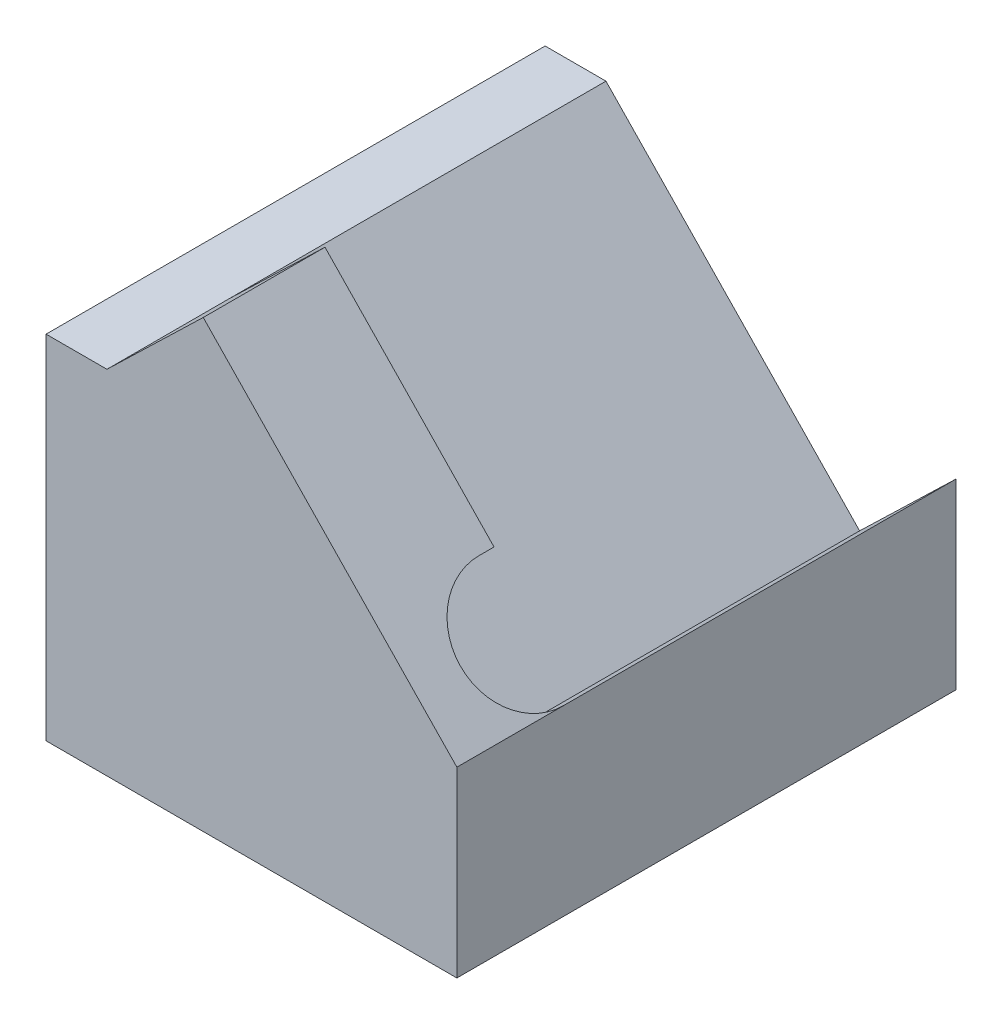
ISO-10303-21;
HEADER;
FILE_DESCRIPTION(('STEP AP214'),'2;1');
FILE_NAME('part.step','',(''),(''),'','','');
FILE_SCHEMA(('AUTOMOTIVE_DESIGN { 1 0 10303 214 1 1 1 1 }'));
ENDSEC;
DATA;
#1=APPLICATION_CONTEXT('core data for automotive mechanical design processes');
#2=APPLICATION_PROTOCOL_DEFINITION('international standard','automotive_design',2000,#1);
#3=PRODUCT_CONTEXT('',#1,'mechanical');
#4=PRODUCT('Part','Part','',(#3));
#5=PRODUCT_RELATED_PRODUCT_CATEGORY('part','',(#4));
#6=PRODUCT_DEFINITION_FORMATION('','',#4);
#7=PRODUCT_DEFINITION_CONTEXT('part definition',#1,'design');
#8=PRODUCT_DEFINITION('design','',#6,#7);
#9=PRODUCT_DEFINITION_SHAPE('','',#8);
#10=(LENGTH_UNIT() NAMED_UNIT(*) SI_UNIT(.MILLI.,.METRE.));
#11=(NAMED_UNIT(*) PLANE_ANGLE_UNIT() SI_UNIT($,.RADIAN.));
#12=(NAMED_UNIT(*) SI_UNIT($,.STERADIAN.) SOLID_ANGLE_UNIT());
#13=UNCERTAINTY_MEASURE_WITH_UNIT(LENGTH_MEASURE(1.E-05),#10,'distance_accuracy_value','');
#14=(GEOMETRIC_REPRESENTATION_CONTEXT(3) GLOBAL_UNCERTAINTY_ASSIGNED_CONTEXT((#13)) GLOBAL_UNIT_ASSIGNED_CONTEXT((#10,
#11,#12)) REPRESENTATION_CONTEXT('',''));
#15=CARTESIAN_POINT('',(0.,0.,0.));
#16=DIRECTION('',(0.,0.,1.));
#17=DIRECTION('',(1.,0.,0.));
#18=AXIS2_PLACEMENT_3D('',#15,#16,#17);
#19=CARTESIAN_POINT('',(6.75,2.,8.2));
#20=DIRECTION('',(-1.,0.,0.));
#21=DIRECTION('',(0.,0.,1.));
#22=AXIS2_PLACEMENT_3D('',#19,#20,#21);
#23=PLANE('',#22);
#24=DIRECTION('',(0.,1.,0.));
#25=VECTOR('',#24,1.);
#26=CARTESIAN_POINT('',(6.75,2.,0.));
#27=LINE('',#26,#25);
#28=CARTESIAN_POINT('',(6.75,-1.,0.));
#29=VERTEX_POINT('',#28);
#30=CARTESIAN_POINT('',(6.75,2.,0.));
#31=VERTEX_POINT('',#30);
#32=EDGE_CURVE('E115',#29,#31,#27,.T.);
#33=ORIENTED_EDGE('',*,*,#32,.T.);
#34=DIRECTION('',(0.,0.,-1.));
#35=VECTOR('',#34,1.);
#36=CARTESIAN_POINT('',(6.75,2.,0.));
#37=LINE('',#36,#35);
#38=CARTESIAN_POINT('',(6.75,2.,6.45));
#39=VERTEX_POINT('',#38);
#40=EDGE_CURVE('E155',#39,#31,#37,.T.);
#41=ORIENTED_EDGE('',*,*,#40,.F.);
#42=DIRECTION('',(0.,0.,-1.));
#43=VECTOR('',#42,1.);
#44=CARTESIAN_POINT('',(6.75,2.,8.2));
#45=LINE('',#44,#43);
#46=CARTESIAN_POINT('',(6.75,2.,8.2));
#47=VERTEX_POINT('',#46);
#48=EDGE_CURVE('E11',#47,#39,#45,.T.);
#49=ORIENTED_EDGE('',*,*,#48,.F.);
#50=DIRECTION('',(0.,1.,0.));
#51=VECTOR('',#50,1.);
#52=CARTESIAN_POINT('',(6.75,2.,8.2));
#53=LINE('',#52,#51);
#54=CARTESIAN_POINT('',(6.75,-1.,8.2));
#55=VERTEX_POINT('',#54);
#56=EDGE_CURVE('E93',#55,#47,#53,.T.);
#57=ORIENTED_EDGE('',*,*,#56,.F.);
#58=DIRECTION('',(0.,0.,1.));
#59=VECTOR('',#58,1.);
#60=CARTESIAN_POINT('',(6.75,-1.,8.2));
#61=LINE('',#60,#59);
#62=EDGE_CURVE('E144',#29,#55,#61,.T.);
#63=ORIENTED_EDGE('',*,*,#62,.F.);
#64=EDGE_LOOP('',(#33,#41,#49,#57,#63));
#65=FACE_BOUND('',#64,.T.);
#66=ADVANCED_FACE('F35',(#65),#23,.F.);
#67=CARTESIAN_POINT('',(2.58254756074503,6.31552333212895,8.2));
#68=DIRECTION('',(-0.71933980033865,-0.694658370458999,0.));
#69=DIRECTION('',(0.694658370458999,-0.71933980033865,0.));
#70=AXIS2_PLACEMENT_3D('',#67,#68,#69);
#71=PLANE('',#70);
#72=ORIENTED_EDGE('',*,*,#48,.T.);
#73=CARTESIAN_POINT('',(6.055341629541,2.71933980033865,6.45));
#74=DIRECTION('',(0.719339800338649,0.694658370458999,0.));
#75=DIRECTION('',(0.694658370458999,-0.719339800338649,0.));
#76=AXIS2_PLACEMENT_3D('',#73,#74,#75);
#77=CIRCLE('',#76,1.);
#78=CARTESIAN_POINT('',(5.360683259082,3.4386796006773,6.45));
#79=VERTEX_POINT('',#78);
#80=EDGE_CURVE('E166',#79,#39,#77,.T.);
#81=ORIENTED_EDGE('',*,*,#80,.F.);
#82=DIRECTION('',(0.,0.,1.));
#83=VECTOR('',#82,1.);
#84=CARTESIAN_POINT('',(5.360683259082,3.4386796006773,6.45));
#85=LINE('',#84,#83);
#86=CARTESIAN_POINT('',(5.360683259082,3.4386796006773,6.2));
#87=VERTEX_POINT('',#86);
#88=EDGE_CURVE('E146',#87,#79,#85,.T.);
#89=ORIENTED_EDGE('',*,*,#88,.F.);
#90=DIRECTION('',(0.694658370458999,-0.719339800338649,0.));
#91=VECTOR('',#90,1.);
#92=CARTESIAN_POINT('',(5.360683259082,3.4386796006773,6.2));
#93=LINE('',#92,#91);
#94=CARTESIAN_POINT('',(2.58254756074503,6.31552333212896,6.2));
#95=VERTEX_POINT('',#94);
#96=EDGE_CURVE('E102',#95,#87,#93,.T.);
#97=ORIENTED_EDGE('',*,*,#96,.F.);
#98=DIRECTION('',(0.,0.,-1.));
#99=VECTOR('',#98,1.);
#100=CARTESIAN_POINT('',(2.58254756074503,6.31552333212895,8.2));
#101=LINE('',#100,#99);
#102=CARTESIAN_POINT('',(2.58254756074503,6.31552333212895,8.2));
#103=VERTEX_POINT('',#102);
#104=EDGE_CURVE('E42',#103,#95,#101,.T.);
#105=ORIENTED_EDGE('',*,*,#104,.F.);
#106=DIRECTION('',(-0.694658370458999,0.719339800338649,0.));
#107=VECTOR('',#106,1.);
#108=CARTESIAN_POINT('',(2.58254756074503,6.31552333212895,8.2));
#109=LINE('',#108,#107);
#110=EDGE_CURVE('E85',#47,#103,#109,.T.);
#111=ORIENTED_EDGE('',*,*,#110,.F.);
#112=EDGE_LOOP('',(#72,#81,#89,#97,#105,#111));
#113=FACE_BOUND('',#112,.T.);
#114=ADVANCED_FACE('F99',(#113),#71,.F.);
#115=CARTESIAN_POINT('',(1.,4.78727491711916,8.2));
#116=DIRECTION('',(0.694658370458999,-0.719339800338649,0.));
#117=DIRECTION('',(0.719339800338649,0.694658370458999,0.));
#118=AXIS2_PLACEMENT_3D('',#115,#116,#117);
#119=PLANE('',#118);
#120=ORIENTED_EDGE('',*,*,#104,.T.);
#121=DIRECTION('',(-0.719339800338649,-0.694658370458999,0.));
#122=VECTOR('',#121,1.);
#123=CARTESIAN_POINT('',(1.,4.78727491711916,6.2));
#124=LINE('',#123,#122);
#125=CARTESIAN_POINT('',(1.,4.78727491711915,6.2));
#126=VERTEX_POINT('',#125);
#127=EDGE_CURVE('E118',#95,#126,#124,.T.);
#128=ORIENTED_EDGE('',*,*,#127,.T.);
#129=DIRECTION('',(0.,0.,-1.));
#130=VECTOR('',#129,1.);
#131=CARTESIAN_POINT('',(1.,4.78727491711916,8.2));
#132=LINE('',#131,#130);
#133=CARTESIAN_POINT('',(1.,4.78727491711916,8.2));
#134=VERTEX_POINT('',#133);
#135=EDGE_CURVE('E105',#134,#126,#132,.T.);
#136=ORIENTED_EDGE('',*,*,#135,.F.);
#137=DIRECTION('',(-0.719339800338649,-0.694658370458999,0.));
#138=VECTOR('',#137,1.);
#139=CARTESIAN_POINT('',(1.,4.78727491711916,8.2));
#140=LINE('',#139,#138);
#141=EDGE_CURVE('E89',#103,#134,#140,.T.);
#142=ORIENTED_EDGE('',*,*,#141,.F.);
#143=EDGE_LOOP('',(#120,#128,#136,#142));
#144=FACE_BOUND('',#143,.T.);
#145=ADVANCED_FACE('F106',(#144),#119,.F.);
#146=CARTESIAN_POINT('',(0.,4.78727491711916,8.2));
#147=DIRECTION('',(0.,-1.,0.));
#148=DIRECTION('',(0.,0.,-1.));
#149=AXIS2_PLACEMENT_3D('',#146,#147,#148);
#150=PLANE('',#149);
#151=DIRECTION('',(-1.,0.,0.));
#152=VECTOR('',#151,1.);
#153=CARTESIAN_POINT('',(0.,4.78727491711916,0.));
#154=LINE('',#153,#152);
#155=CARTESIAN_POINT('',(1.,4.78727491711916,0.));
#156=VERTEX_POINT('',#155);
#157=CARTESIAN_POINT('',(0.,4.78727491711916,0.));
#158=VERTEX_POINT('',#157);
#159=EDGE_CURVE('E70',#156,#158,#154,.T.);
#160=ORIENTED_EDGE('',*,*,#159,.T.);
#161=DIRECTION('',(0.,0.,-1.));
#162=VECTOR('',#161,1.);
#163=CARTESIAN_POINT('',(0.,4.78727491711916,8.2));
#164=LINE('',#163,#162);
#165=CARTESIAN_POINT('',(0.,4.78727491711916,8.2));
#166=VERTEX_POINT('',#165);
#167=EDGE_CURVE('E114',#166,#158,#164,.T.);
#168=ORIENTED_EDGE('',*,*,#167,.F.);
#169=DIRECTION('',(-1.,0.,0.));
#170=VECTOR('',#169,1.);
#171=CARTESIAN_POINT('',(0.,4.78727491711916,8.2));
#172=LINE('',#171,#170);
#173=EDGE_CURVE('E58',#134,#166,#172,.T.);
#174=ORIENTED_EDGE('',*,*,#173,.F.);
#175=ORIENTED_EDGE('',*,*,#135,.T.);
#176=DIRECTION('',(0.,0.,-1.));
#177=VECTOR('',#176,1.);
#178=CARTESIAN_POINT('',(1.,4.78727491711916,8.2));
#179=LINE('',#178,#177);
#180=EDGE_CURVE('E78',#126,#156,#179,.T.);
#181=ORIENTED_EDGE('',*,*,#180,.T.);
#182=EDGE_LOOP('',(#160,#168,#174,#175,#181));
#183=FACE_BOUND('',#182,.T.);
#184=ADVANCED_FACE('F124',(#183),#150,.F.);
#185=CARTESIAN_POINT('',(0.,0.,8.2));
#186=DIRECTION('',(1.,0.,0.));
#187=DIRECTION('',(0.,0.,-1.));
#188=AXIS2_PLACEMENT_3D('',#185,#186,#187);
#189=PLANE('',#188);
#190=DIRECTION('',(0.,-1.,0.));
#191=VECTOR('',#190,1.);
#192=CARTESIAN_POINT('',(0.,0.,0.));
#193=LINE('',#192,#191);
#194=CARTESIAN_POINT('',(0.,-1.,0.));
#195=VERTEX_POINT('',#194);
#196=EDGE_CURVE('E120',#158,#195,#193,.T.);
#197=ORIENTED_EDGE('',*,*,#196,.T.);
#198=DIRECTION('',(0.,0.,-1.));
#199=VECTOR('',#198,1.);
#200=CARTESIAN_POINT('',(0.,-1.,8.2));
#201=LINE('',#200,#199);
#202=CARTESIAN_POINT('',(0.,-1.,8.2));
#203=VERTEX_POINT('',#202);
#204=EDGE_CURVE('E132',#203,#195,#201,.T.);
#205=ORIENTED_EDGE('',*,*,#204,.F.);
#206=DIRECTION('',(0.,-1.,0.));
#207=VECTOR('',#206,1.);
#208=CARTESIAN_POINT('',(0.,0.,8.2));
#209=LINE('',#208,#207);
#210=EDGE_CURVE('E109',#166,#203,#209,.T.);
#211=ORIENTED_EDGE('',*,*,#210,.F.);
#212=ORIENTED_EDGE('',*,*,#167,.T.);
#213=EDGE_LOOP('',(#197,#205,#211,#212));
#214=FACE_BOUND('',#213,.T.);
#215=ADVANCED_FACE('F129',(#214),#189,.F.);
#216=CARTESIAN_POINT('',(0.,0.,8.2));
#217=DIRECTION('',(0.,0.,-1.));
#218=DIRECTION('',(-1.,0.,0.));
#219=AXIS2_PLACEMENT_3D('',#216,#217,#218);
#220=PLANE('',#219);
#221=ORIENTED_EDGE('',*,*,#210,.T.);
#222=DIRECTION('',(-1.,0.,0.));
#223=VECTOR('',#222,1.);
#224=CARTESIAN_POINT('',(0.,-1.,8.2));
#225=LINE('',#224,#223);
#226=EDGE_CURVE('E135',#55,#203,#225,.T.);
#227=ORIENTED_EDGE('',*,*,#226,.F.);
#228=ORIENTED_EDGE('',*,*,#56,.T.);
#229=ORIENTED_EDGE('',*,*,#110,.T.);
#230=ORIENTED_EDGE('',*,*,#141,.T.);
#231=ORIENTED_EDGE('',*,*,#173,.T.);
#232=EDGE_LOOP('',(#221,#227,#228,#229,#230,#231));
#233=FACE_BOUND('',#232,.T.);
#234=ADVANCED_FACE('F87',(#233),#220,.F.);
#235=CARTESIAN_POINT('',(0.,0.,0.));
#236=DIRECTION('',(0.,0.,-1.));
#237=DIRECTION('',(-1.,0.,0.));
#238=AXIS2_PLACEMENT_3D('',#235,#236,#237);
#239=PLANE('',#238);
#240=DIRECTION('',(0.719339800338649,0.694658370458999,0.));
#241=VECTOR('',#240,1.);
#242=CARTESIAN_POINT('',(5.16745243925497,0.471751584990203,0.));
#243=LINE('',#242,#241);
#244=CARTESIAN_POINT('',(5.16745243925498,0.471751584990202,0.));
#245=VERTEX_POINT('',#244);
#246=EDGE_CURVE('E171',#245,#31,#243,.T.);
#247=ORIENTED_EDGE('',*,*,#246,.T.);
#248=ORIENTED_EDGE('',*,*,#32,.F.);
#249=DIRECTION('',(1.,0.,0.));
#250=VECTOR('',#249,1.);
#251=CARTESIAN_POINT('',(0.,-1.,0.));
#252=LINE('',#251,#250);
#253=EDGE_CURVE('E148',#195,#29,#252,.T.);
#254=ORIENTED_EDGE('',*,*,#253,.F.);
#255=ORIENTED_EDGE('',*,*,#196,.F.);
#256=ORIENTED_EDGE('',*,*,#159,.F.);
#257=DIRECTION('',(-0.694658370458999,0.719339800338649,0.));
#258=VECTOR('',#257,1.);
#259=CARTESIAN_POINT('',(0.652173031271479,5.14746028719143,0.));
#260=LINE('',#259,#258);
#261=EDGE_CURVE('E152',#245,#156,#260,.T.);
#262=ORIENTED_EDGE('',*,*,#261,.F.);
#263=EDGE_LOOP('',(#247,#248,#254,#255,#256,#262));
#264=FACE_BOUND('',#263,.T.);
#265=ADVANCED_FACE('F259',(#264),#239,.T.);
#266=CARTESIAN_POINT('',(3.77813569833698,1.9104311856675,6.2));
#267=DIRECTION('',(0.,0.,1.));
#268=DIRECTION('',(1.,0.,0.));
#269=AXIS2_PLACEMENT_3D('',#266,#267,#268);
#270=PLANE('',#269);
#271=ORIENTED_EDGE('',*,*,#96,.T.);
#272=DIRECTION('',(0.719339800338649,0.694658370458999,0.));
#273=VECTOR('',#272,1.);
#274=CARTESIAN_POINT('',(3.77813569833698,1.9104311856675,6.2));
#275=LINE('',#274,#273);
#276=CARTESIAN_POINT('',(3.77813569833698,1.9104311856675,6.2));
#277=VERTEX_POINT('',#276);
#278=EDGE_CURVE('E162',#277,#87,#275,.T.);
#279=ORIENTED_EDGE('',*,*,#278,.F.);
#280=DIRECTION('',(0.694658370458999,-0.719339800338649,0.));
#281=VECTOR('',#280,1.);
#282=CARTESIAN_POINT('',(3.77813569833698,1.9104311856675,6.2));
#283=LINE('',#282,#281);
#284=EDGE_CURVE('E154',#126,#277,#283,.T.);
#285=ORIENTED_EDGE('',*,*,#284,.F.);
#286=ORIENTED_EDGE('',*,*,#127,.F.);
#287=EDGE_LOOP('',(#271,#279,#285,#286));
#288=FACE_BOUND('',#287,.T.);
#289=ADVANCED_FACE('F185',(#288),#270,.F.);
#290=CARTESIAN_POINT('',(4.47279406879598,1.19109138532885,6.45));
#291=DIRECTION('',(-0.719339800338649,-0.694658370458999,0.));
#292=DIRECTION('',(0.694658370458999,-0.719339800338649,0.));
#293=AXIS2_PLACEMENT_3D('',#290,#291,#292);
#294=PLANE('',#293);
#295=ORIENTED_EDGE('',*,*,#284,.T.);
#296=DIRECTION('',(0.,0.,1.));
#297=VECTOR('',#296,1.);
#298=CARTESIAN_POINT('',(3.77813569833698,1.9104311856675,6.45));
#299=LINE('',#298,#297);
#300=CARTESIAN_POINT('',(3.77813569833698,1.9104311856675,6.45));
#301=VERTEX_POINT('',#300);
#302=EDGE_CURVE('E157',#277,#301,#299,.T.);
#303=ORIENTED_EDGE('',*,*,#302,.T.);
#304=CARTESIAN_POINT('',(4.47279406879598,1.19109138532885,6.45));
#305=DIRECTION('',(0.719339800338649,0.694658370458999,0.));
#306=DIRECTION('',(0.694658370458999,-0.719339800338649,0.));
#307=AXIS2_PLACEMENT_3D('',#304,#305,#306);
#308=CIRCLE('',#307,1.);
#309=CARTESIAN_POINT('',(5.16745243925497,0.471751584990203,6.45));
#310=VERTEX_POINT('',#309);
#311=EDGE_CURVE('E160',#301,#310,#308,.T.);
#312=ORIENTED_EDGE('',*,*,#311,.T.);
#313=DIRECTION('',(0.,0.,-1.));
#314=VECTOR('',#313,1.);
#315=CARTESIAN_POINT('',(5.16745243925497,0.471751584990203,0.));
#316=LINE('',#315,#314);
#317=EDGE_CURVE('E49',#310,#245,#316,.T.);
#318=ORIENTED_EDGE('',*,*,#317,.T.);
#319=ORIENTED_EDGE('',*,*,#261,.T.);
#320=ORIENTED_EDGE('',*,*,#180,.F.);
#321=EDGE_LOOP('',(#295,#303,#312,#318,#319,#320));
#322=FACE_BOUND('',#321,.T.);
#323=ADVANCED_FACE('F255',(#322),#294,.F.);
#324=CARTESIAN_POINT('',(5.16745243925497,0.471751584990203,0.));
#325=DIRECTION('',(0.694658370458999,-0.71933980033865,0.));
#326=DIRECTION('',(0.719339800338649,0.694658370458999,0.));
#327=AXIS2_PLACEMENT_3D('',#324,#325,#326);
#328=PLANE('',#327);
#329=ORIENTED_EDGE('',*,*,#40,.T.);
#330=ORIENTED_EDGE('',*,*,#246,.F.);
#331=ORIENTED_EDGE('',*,*,#317,.F.);
#332=DIRECTION('',(0.719339800338649,0.694658370458999,0.));
#333=VECTOR('',#332,1.);
#334=CARTESIAN_POINT('',(5.16745243925497,0.471751584990203,6.45));
#335=LINE('',#334,#333);
#336=EDGE_CURVE('E174',#310,#39,#335,.T.);
#337=ORIENTED_EDGE('',*,*,#336,.T.);
#338=EDGE_LOOP('',(#329,#330,#331,#337));
#339=FACE_BOUND('',#338,.T.);
#340=ADVANCED_FACE('F257',(#339),#328,.F.);
#341=CARTESIAN_POINT('',(4.47279406879598,1.19109138532885,6.45));
#342=DIRECTION('',(0.719339800338649,0.694658370458999,0.));
#343=DIRECTION('',(-0.694658370458999,0.719339800338649,0.));
#344=AXIS2_PLACEMENT_3D('',#341,#342,#343);
#345=CYLINDRICAL_SURFACE('',#344,1.);
#346=ORIENTED_EDGE('',*,*,#80,.T.);
#347=ORIENTED_EDGE('',*,*,#336,.F.);
#348=ORIENTED_EDGE('',*,*,#311,.F.);
#349=DIRECTION('',(0.719339800338649,0.694658370458999,0.));
#350=VECTOR('',#349,1.);
#351=CARTESIAN_POINT('',(3.77813569833698,1.9104311856675,6.45));
#352=LINE('',#351,#350);
#353=EDGE_CURVE('E177',#301,#79,#352,.T.);
#354=ORIENTED_EDGE('',*,*,#353,.T.);
#355=EDGE_LOOP('',(#346,#347,#348,#354));
#356=FACE_BOUND('',#355,.T.);
#357=ADVANCED_FACE('F250',(#356),#345,.F.);
#358=CARTESIAN_POINT('',(3.77813569833698,1.9104311856675,6.45));
#359=DIRECTION('',(-0.694658370458999,0.719339800338649,0.));
#360=DIRECTION('',(-0.719339800338649,-0.694658370458999,0.));
#361=AXIS2_PLACEMENT_3D('',#358,#359,#360);
#362=PLANE('',#361);
#363=ORIENTED_EDGE('',*,*,#88,.T.);
#364=ORIENTED_EDGE('',*,*,#353,.F.);
#365=ORIENTED_EDGE('',*,*,#302,.F.);
#366=ORIENTED_EDGE('',*,*,#278,.T.);
#367=EDGE_LOOP('',(#363,#364,#365,#366));
#368=FACE_BOUND('',#367,.T.);
#369=ADVANCED_FACE('F254',(#368),#362,.F.);
#370=CARTESIAN_POINT('',(0.,-1.,0.));
#371=DIRECTION('',(0.,-1.,0.));
#372=DIRECTION('',(1.,0.,0.));
#373=AXIS2_PLACEMENT_3D('',#370,#371,#372);
#374=PLANE('',#373);
#375=CARTESIAN_POINT('',(3.,-1.,4.1));
#376=DIRECTION('',(0.,-1.,0.));
#377=DIRECTION('',(0.,0.,-1.));
#378=AXIS2_PLACEMENT_3D('',#375,#376,#377);
#379=CIRCLE('',#378,0.79999999999999);
#380=CARTESIAN_POINT('',(3.,-1.,3.30000000000001));
#381=VERTEX_POINT('',#380);
#382=EDGE_CURVE('E228',#381,#381,#379,.T.);
#383=ORIENTED_EDGE('',*,*,#382,.F.);
#384=EDGE_LOOP('',(#383));
#385=FACE_BOUND('',#384,.T.);
#386=CARTESIAN_POINT('',(3.,-1.,7.1));
#387=DIRECTION('',(0.,-1.,0.));
#388=DIRECTION('',(0.,0.,-1.));
#389=AXIS2_PLACEMENT_3D('',#386,#387,#388);
#390=CIRCLE('',#389,0.749999999999989);
#391=CARTESIAN_POINT('',(3.,-1.,6.35000000000001));
#392=VERTEX_POINT('',#391);
#393=EDGE_CURVE('E227',#392,#392,#390,.T.);
#394=ORIENTED_EDGE('',*,*,#393,.F.);
#395=EDGE_LOOP('',(#394));
#396=FACE_BOUND('',#395,.T.);
#397=CARTESIAN_POINT('',(3.,-1.,1.1));
#398=DIRECTION('',(0.,-1.,0.));
#399=DIRECTION('',(0.,0.,-1.));
#400=AXIS2_PLACEMENT_3D('',#397,#398,#399);
#401=CIRCLE('',#400,0.749999999999989);
#402=CARTESIAN_POINT('',(3.,-1.,0.350000000000011));
#403=VERTEX_POINT('',#402);
#404=EDGE_CURVE('E238',#403,#403,#401,.T.);
#405=ORIENTED_EDGE('',*,*,#404,.F.);
#406=EDGE_LOOP('',(#405));
#407=FACE_BOUND('',#406,.T.);
#408=ORIENTED_EDGE('',*,*,#204,.T.);
#409=ORIENTED_EDGE('',*,*,#253,.T.);
#410=ORIENTED_EDGE('',*,*,#62,.T.);
#411=ORIENTED_EDGE('',*,*,#226,.T.);
#412=EDGE_LOOP('',(#408,#409,#410,#411));
#413=FACE_BOUND('',#412,.T.);
#414=ADVANCED_FACE('F140',(#385,#396,#407,#413),#374,.T.);
#415=CARTESIAN_POINT('',(3.,0.5,1.1));
#416=DIRECTION('',(0.,-1.,0.));
#417=DIRECTION('',(0.,0.,-1.));
#418=AXIS2_PLACEMENT_3D('',#415,#416,#417);
#419=CONICAL_SURFACE('',#418,0.749999999999999,1.02974425867665);
#420=CARTESIAN_POINT('',(3.,0.95064546427067,1.1));
#421=VERTEX_POINT('',#420);
#422=VERTEX_LOOP('',#421);
#423=FACE_BOUND('',#422,.T.);
#424=CARTESIAN_POINT('',(3.,0.5,1.1));
#425=DIRECTION('',(0.,-1.,0.));
#426=DIRECTION('',(0.,0.,-1.));
#427=AXIS2_PLACEMENT_3D('',#424,#425,#426);
#428=CIRCLE('',#427,0.749999999999999);
#429=CARTESIAN_POINT('',(3.,0.5,0.35));
#430=VERTEX_POINT('',#429);
#431=EDGE_CURVE('E241',#430,#430,#428,.T.);
#432=ORIENTED_EDGE('',*,*,#431,.T.);
#433=EDGE_LOOP('',(#432));
#434=FACE_BOUND('',#433,.T.);
#435=ADVANCED_FACE('F300',(#423,#434),#419,.F.);
#436=CARTESIAN_POINT('',(3.,-1.,1.1));
#437=DIRECTION('',(0.,-1.,0.));
#438=DIRECTION('',(0.,0.,-1.));
#439=AXIS2_PLACEMENT_3D('',#436,#437,#438);
#440=CYLINDRICAL_SURFACE('',#439,0.749999999999994);
#441=ORIENTED_EDGE('',*,*,#431,.F.);
#442=EDGE_LOOP('',(#441));
#443=FACE_BOUND('',#442,.T.);
#444=ORIENTED_EDGE('',*,*,#404,.T.);
#445=EDGE_LOOP('',(#444));
#446=FACE_BOUND('',#445,.T.);
#447=ADVANCED_FACE('F305',(#443,#446),#440,.F.);
#448=CARTESIAN_POINT('',(3.,0.5,7.1));
#449=DIRECTION('',(0.,-1.,0.));
#450=DIRECTION('',(0.,0.,-1.));
#451=AXIS2_PLACEMENT_3D('',#448,#449,#450);
#452=CONICAL_SURFACE('',#451,0.749999999999999,1.02974425867665);
#453=CARTESIAN_POINT('',(3.,0.95064546427067,7.1));
#454=VERTEX_POINT('',#453);
#455=VERTEX_LOOP('',#454);
#456=FACE_BOUND('',#455,.T.);
#457=CARTESIAN_POINT('',(3.,0.5,7.1));
#458=DIRECTION('',(0.,-1.,0.));
#459=DIRECTION('',(0.,0.,-1.));
#460=AXIS2_PLACEMENT_3D('',#457,#458,#459);
#461=CIRCLE('',#460,0.749999999999999);
#462=CARTESIAN_POINT('',(3.,0.5,6.35));
#463=VERTEX_POINT('',#462);
#464=EDGE_CURVE('E231',#463,#463,#461,.T.);
#465=ORIENTED_EDGE('',*,*,#464,.T.);
#466=EDGE_LOOP('',(#465));
#467=FACE_BOUND('',#466,.T.);
#468=ADVANCED_FACE('F316',(#456,#467),#452,.F.);
#469=CARTESIAN_POINT('',(3.,-1.,7.1));
#470=DIRECTION('',(0.,-1.,0.));
#471=DIRECTION('',(0.,0.,-1.));
#472=AXIS2_PLACEMENT_3D('',#469,#470,#471);
#473=CYLINDRICAL_SURFACE('',#472,0.749999999999994);
#474=ORIENTED_EDGE('',*,*,#464,.F.);
#475=EDGE_LOOP('',(#474));
#476=FACE_BOUND('',#475,.T.);
#477=ORIENTED_EDGE('',*,*,#393,.T.);
#478=EDGE_LOOP('',(#477));
#479=FACE_BOUND('',#478,.T.);
#480=ADVANCED_FACE('F221',(#476,#479),#473,.F.);
#481=CARTESIAN_POINT('',(3.,1.5,4.1));
#482=DIRECTION('',(0.,-1.,0.));
#483=DIRECTION('',(0.,0.,-1.));
#484=AXIS2_PLACEMENT_3D('',#481,#482,#483);
#485=CONICAL_SURFACE('',#484,0.799999999999999,1.02974425867665);
#486=CARTESIAN_POINT('',(3.,1.98068849522205,4.1));
#487=VERTEX_POINT('',#486);
#488=VERTEX_LOOP('',#487);
#489=FACE_BOUND('',#488,.T.);
#490=CARTESIAN_POINT('',(3.,1.5,4.1));
#491=DIRECTION('',(0.,-1.,0.));
#492=DIRECTION('',(0.,0.,-1.));
#493=AXIS2_PLACEMENT_3D('',#490,#491,#492);
#494=CIRCLE('',#493,0.799999999999999);
#495=CARTESIAN_POINT('',(3.,1.5,3.3));
#496=VERTEX_POINT('',#495);
#497=EDGE_CURVE('E225',#496,#496,#494,.T.);
#498=ORIENTED_EDGE('',*,*,#497,.T.);
#499=EDGE_LOOP('',(#498));
#500=FACE_BOUND('',#499,.T.);
#501=ADVANCED_FACE('F217',(#489,#500),#485,.F.);
#502=CARTESIAN_POINT('',(3.,-1.,4.1));
#503=DIRECTION('',(0.,-1.,0.));
#504=DIRECTION('',(0.,0.,-1.));
#505=AXIS2_PLACEMENT_3D('',#502,#503,#504);
#506=CYLINDRICAL_SURFACE('',#505,0.799999999999994);
#507=ORIENTED_EDGE('',*,*,#497,.F.);
#508=EDGE_LOOP('',(#507));
#509=FACE_BOUND('',#508,.T.);
#510=ORIENTED_EDGE('',*,*,#382,.T.);
#511=EDGE_LOOP('',(#510));
#512=FACE_BOUND('',#511,.T.);
#513=ADVANCED_FACE('F220',(#509,#512),#506,.F.);
#514=CLOSED_SHELL('',(#66,#114,#145,#184,#215,#234,#265,#289,#323,#340,#357,#369,#414,#435,#447,
#468,#480,#501,#513));
#515=MANIFOLD_SOLID_BREP('B2',#514);
#516=ADVANCED_BREP_SHAPE_REPRESENTATION('',(#18,#515),#14);
#517=SHAPE_DEFINITION_REPRESENTATION(#9,#516);
ENDSEC;
END-ISO-10303-21;
